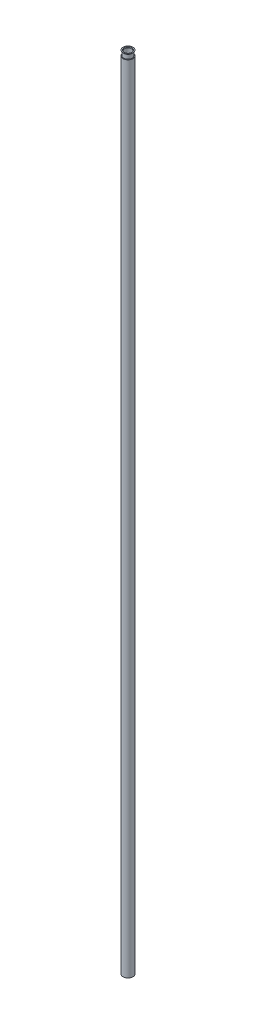
ISO-10303-21;
HEADER;
FILE_DESCRIPTION(('STEP AP214'),'2;1');
FILE_NAME('part.step','',(''),(''),'','','');
FILE_SCHEMA(('AUTOMOTIVE_DESIGN { 1 0 10303 214 1 1 1 1 }'));
ENDSEC;
DATA;
#1=APPLICATION_CONTEXT('core data for automotive mechanical design processes');
#2=APPLICATION_PROTOCOL_DEFINITION('international standard','automotive_design',2000,#1);
#3=PRODUCT_CONTEXT('',#1,'mechanical');
#4=PRODUCT('Part','Part','',(#3));
#5=PRODUCT_RELATED_PRODUCT_CATEGORY('part','',(#4));
#6=PRODUCT_DEFINITION_FORMATION('','',#4);
#7=PRODUCT_DEFINITION_CONTEXT('part definition',#1,'design');
#8=PRODUCT_DEFINITION('design','',#6,#7);
#9=PRODUCT_DEFINITION_SHAPE('','',#8);
#10=(LENGTH_UNIT() NAMED_UNIT(*) SI_UNIT(.MILLI.,.METRE.));
#11=(NAMED_UNIT(*) PLANE_ANGLE_UNIT() SI_UNIT($,.RADIAN.));
#12=(NAMED_UNIT(*) SI_UNIT($,.STERADIAN.) SOLID_ANGLE_UNIT());
#13=UNCERTAINTY_MEASURE_WITH_UNIT(LENGTH_MEASURE(1.E-05),#10,'distance_accuracy_value','');
#14=(GEOMETRIC_REPRESENTATION_CONTEXT(3) GLOBAL_UNCERTAINTY_ASSIGNED_CONTEXT((#13)) GLOBAL_UNIT_ASSIGNED_CONTEXT((#10,
#11,#12)) REPRESENTATION_CONTEXT('',''));
#15=CARTESIAN_POINT('',(0.,0.,0.));
#16=DIRECTION('',(0.,0.,1.));
#17=DIRECTION('',(1.,0.,0.));
#18=AXIS2_PLACEMENT_3D('',#15,#16,#17);
#19=CARTESIAN_POINT('',(0.,800.,0.));
#20=DIRECTION('',(0.,-1.,0.));
#21=DIRECTION('',(0.,0.,-1.));
#22=AXIS2_PLACEMENT_3D('',#19,#20,#21);
#23=CYLINDRICAL_SURFACE('',#22,4.99999999988474);
#24=CARTESIAN_POINT('',(0.,800.,0.));
#25=DIRECTION('',(0.,-1.,0.));
#26=DIRECTION('',(0.,0.,-1.));
#27=AXIS2_PLACEMENT_3D('',#24,#25,#26);
#28=CIRCLE('',#27,4.99999999988474);
#29=CARTESIAN_POINT('',(0.,800.,-4.99999999988474));
#30=VERTEX_POINT('',#29);
#31=EDGE_CURVE('E40',#30,#30,#28,.T.);
#32=ORIENTED_EDGE('',*,*,#31,.T.);
#33=EDGE_LOOP('',(#32));
#34=FACE_BOUND('',#33,.T.);
#35=CARTESIAN_POINT('',(0.,0.,0.));
#36=DIRECTION('',(0.,1.,0.));
#37=DIRECTION('',(0.,0.,1.));
#38=AXIS2_PLACEMENT_3D('',#35,#36,#37);
#39=CIRCLE('',#38,4.99999999988474);
#40=CARTESIAN_POINT('',(0.,0.,4.99999999988474));
#41=VERTEX_POINT('',#40);
#42=EDGE_CURVE('E10',#41,#41,#39,.T.);
#43=ORIENTED_EDGE('',*,*,#42,.T.);
#44=EDGE_LOOP('',(#43));
#45=FACE_BOUND('',#44,.T.);
#46=ADVANCED_FACE('F30',(#34,#45),#23,.T.);
#47=CARTESIAN_POINT('',(0.,0.,0.));
#48=DIRECTION('',(0.,1.,0.));
#49=DIRECTION('',(0.,0.,1.));
#50=AXIS2_PLACEMENT_3D('',#47,#48,#49);
#51=PLANE('',#50);
#52=CARTESIAN_POINT('',(0.,0.,0.));
#53=DIRECTION('',(0.,-1.,0.));
#54=DIRECTION('',(0.,0.,-1.));
#55=AXIS2_PLACEMENT_3D('',#52,#53,#54);
#56=CIRCLE('',#55,3.5);
#57=CARTESIAN_POINT('',(0.,0.,-3.5));
#58=VERTEX_POINT('',#57);
#59=EDGE_CURVE('E36',#58,#58,#56,.T.);
#60=ORIENTED_EDGE('',*,*,#59,.F.);
#61=EDGE_LOOP('',(#60));
#62=FACE_BOUND('',#61,.T.);
#63=ORIENTED_EDGE('',*,*,#42,.F.);
#64=EDGE_LOOP('',(#63));
#65=FACE_BOUND('',#64,.T.);
#66=ADVANCED_FACE('F74',(#62,#65),#51,.F.);
#67=CARTESIAN_POINT('',(0.,800.,0.));
#68=DIRECTION('',(0.,-1.,0.));
#69=DIRECTION('',(0.,0.,-1.));
#70=AXIS2_PLACEMENT_3D('',#67,#68,#69);
#71=CYLINDRICAL_SURFACE('',#70,3.5);
#72=ORIENTED_EDGE('',*,*,#59,.T.);
#73=EDGE_LOOP('',(#72));
#74=FACE_BOUND('',#73,.T.);
#75=CARTESIAN_POINT('',(0.,804.5,0.));
#76=DIRECTION('',(0.,1.,0.));
#77=DIRECTION('',(0.,0.,1.));
#78=AXIS2_PLACEMENT_3D('',#75,#76,#77);
#79=CIRCLE('',#78,3.5);
#80=CARTESIAN_POINT('',(0.,804.5,3.5));
#81=VERTEX_POINT('',#80);
#82=EDGE_CURVE('E44',#81,#81,#79,.T.);
#83=ORIENTED_EDGE('',*,*,#82,.T.);
#84=EDGE_LOOP('',(#83));
#85=FACE_BOUND('',#84,.T.);
#86=ADVANCED_FACE('F69',(#74,#85),#71,.F.);
#87=CARTESIAN_POINT('',(-6.34949463033716,800.,-6.));
#88=DIRECTION('',(0.,-1.,0.));
#89=DIRECTION('',(0.,0.,-1.));
#90=AXIS2_PLACEMENT_3D('',#87,#88,#89);
#91=PLANE('',#90);
#92=CARTESIAN_POINT('',(0.,800.,0.));
#93=DIRECTION('',(0.,1.,0.));
#94=DIRECTION('',(0.,0.,1.));
#95=AXIS2_PLACEMENT_3D('',#92,#93,#94);
#96=CIRCLE('',#95,4.26000000000004);
#97=CARTESIAN_POINT('',(0.,800.,4.26000000000004));
#98=VERTEX_POINT('',#97);
#99=EDGE_CURVE('E58',#98,#98,#96,.T.);
#100=ORIENTED_EDGE('',*,*,#99,.F.);
#101=EDGE_LOOP('',(#100));
#102=FACE_BOUND('',#101,.T.);
#103=ORIENTED_EDGE('',*,*,#31,.F.);
#104=EDGE_LOOP('',(#103));
#105=FACE_BOUND('',#104,.T.);
#106=ADVANCED_FACE('F65',(#102,#105),#91,.F.);
#107=CARTESIAN_POINT('',(0.,804.5,0.));
#108=DIRECTION('',(0.,1.,0.));
#109=DIRECTION('',(0.,0.,1.));
#110=AXIS2_PLACEMENT_3D('',#107,#108,#109);
#111=CONICAL_SURFACE('',#110,3.5,0.785398163397503);
#112=CARTESIAN_POINT('',(0.,805.,0.));
#113=DIRECTION('',(0.,1.,0.));
#114=DIRECTION('',(0.,0.,1.));
#115=AXIS2_PLACEMENT_3D('',#112,#113,#114);
#116=CIRCLE('',#115,4.);
#117=CARTESIAN_POINT('',(0.,805.,4.));
#118=VERTEX_POINT('',#117);
#119=EDGE_CURVE('E49',#118,#118,#116,.T.);
#120=ORIENTED_EDGE('',*,*,#119,.T.);
#121=EDGE_LOOP('',(#120));
#122=FACE_BOUND('',#121,.T.);
#123=ORIENTED_EDGE('',*,*,#82,.F.);
#124=EDGE_LOOP('',(#123));
#125=FACE_BOUND('',#124,.T.);
#126=ADVANCED_FACE('F68',(#122,#125),#111,.F.);
#127=CARTESIAN_POINT('',(-4.,805.,0.));
#128=DIRECTION('',(0.,1.,0.));
#129=DIRECTION('',(0.,0.,1.));
#130=AXIS2_PLACEMENT_3D('',#127,#128,#129);
#131=PLANE('',#130);
#132=CARTESIAN_POINT('',(0.,805.,0.));
#133=DIRECTION('',(0.,1.,0.));
#134=DIRECTION('',(0.,0.,1.));
#135=AXIS2_PLACEMENT_3D('',#132,#133,#134);
#136=CIRCLE('',#135,4.99999999988473);
#137=CARTESIAN_POINT('',(0.,805.,4.99999999988473));
#138=VERTEX_POINT('',#137);
#139=EDGE_CURVE('E52',#138,#138,#136,.T.);
#140=ORIENTED_EDGE('',*,*,#139,.T.);
#141=EDGE_LOOP('',(#140));
#142=FACE_BOUND('',#141,.T.);
#143=ORIENTED_EDGE('',*,*,#119,.F.);
#144=EDGE_LOOP('',(#143));
#145=FACE_BOUND('',#144,.T.);
#146=ADVANCED_FACE('F87',(#142,#145),#131,.T.);
#147=CARTESIAN_POINT('',(0.,805.,0.));
#148=DIRECTION('',(0.,1.,0.));
#149=DIRECTION('',(0.,0.,1.));
#150=AXIS2_PLACEMENT_3D('',#147,#148,#149);
#151=CONICAL_SURFACE('',#150,4.99999999988473,0.778686854726684);
#152=CARTESIAN_POINT('',(0.,804.250000000058,0.));
#153=DIRECTION('',(0.,1.,0.));
#154=DIRECTION('',(0.,0.,1.));
#155=AXIS2_PLACEMENT_3D('',#152,#153,#154);
#156=CIRCLE('',#155,4.26000000000004);
#157=CARTESIAN_POINT('',(0.,804.250000000058,4.26000000000004));
#158=VERTEX_POINT('',#157);
#159=EDGE_CURVE('E55',#158,#158,#156,.T.);
#160=ORIENTED_EDGE('',*,*,#159,.T.);
#161=EDGE_LOOP('',(#160));
#162=FACE_BOUND('',#161,.T.);
#163=ORIENTED_EDGE('',*,*,#139,.F.);
#164=EDGE_LOOP('',(#163));
#165=FACE_BOUND('',#164,.T.);
#166=ADVANCED_FACE('F91',(#162,#165),#151,.T.);
#167=CARTESIAN_POINT('',(0.,810.031166981494,0.));
#168=DIRECTION('',(0.,1.,0.));
#169=DIRECTION('',(0.,0.,1.));
#170=AXIS2_PLACEMENT_3D('',#167,#168,#169);
#171=CYLINDRICAL_SURFACE('',#170,4.26000000000004);
#172=ORIENTED_EDGE('',*,*,#99,.T.);
#173=EDGE_LOOP('',(#172));
#174=FACE_BOUND('',#173,.T.);
#175=ORIENTED_EDGE('',*,*,#159,.F.);
#176=EDGE_LOOP('',(#175));
#177=FACE_BOUND('',#176,.T.);
#178=ADVANCED_FACE('F62',(#174,#177),#171,.T.);
#179=CLOSED_SHELL('',(#46,#66,#86,#106,#126,#146,#166,#178));
#180=MANIFOLD_SOLID_BREP('B2',#179);
#181=ADVANCED_BREP_SHAPE_REPRESENTATION('',(#18,#180),#14);
#182=SHAPE_DEFINITION_REPRESENTATION(#9,#181);
ENDSEC;
END-ISO-10303-21;
